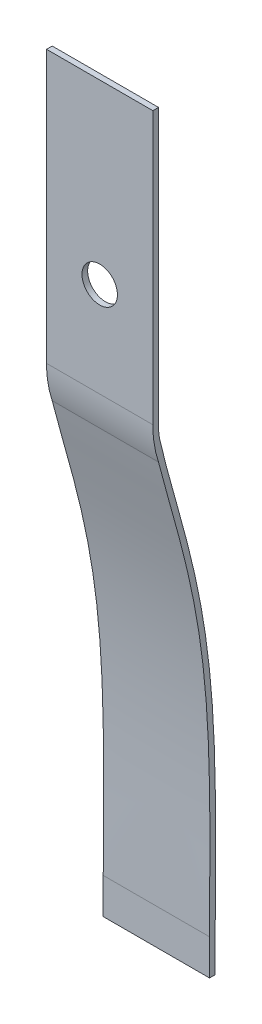
ISO-10303-21;
HEADER;
FILE_DESCRIPTION(('STEP AP214'),'2;1');
FILE_NAME('part.step','',(''),(''),'','','');
FILE_SCHEMA(('AUTOMOTIVE_DESIGN { 1 0 10303 214 1 1 1 1 }'));
ENDSEC;
DATA;
#1=APPLICATION_CONTEXT('core data for automotive mechanical design processes');
#2=APPLICATION_PROTOCOL_DEFINITION('international standard','automotive_design',2000,#1);
#3=PRODUCT_CONTEXT('',#1,'mechanical');
#4=PRODUCT('Part','Part','',(#3));
#5=PRODUCT_RELATED_PRODUCT_CATEGORY('part','',(#4));
#6=PRODUCT_DEFINITION_FORMATION('','',#4);
#7=PRODUCT_DEFINITION_CONTEXT('part definition',#1,'design');
#8=PRODUCT_DEFINITION('design','',#6,#7);
#9=PRODUCT_DEFINITION_SHAPE('','',#8);
#10=(LENGTH_UNIT() NAMED_UNIT(*) SI_UNIT(.MILLI.,.METRE.));
#11=(NAMED_UNIT(*) PLANE_ANGLE_UNIT() SI_UNIT($,.RADIAN.));
#12=(NAMED_UNIT(*) SI_UNIT($,.STERADIAN.) SOLID_ANGLE_UNIT());
#13=UNCERTAINTY_MEASURE_WITH_UNIT(LENGTH_MEASURE(1.E-05),#10,'distance_accuracy_value','');
#14=(GEOMETRIC_REPRESENTATION_CONTEXT(3) GLOBAL_UNCERTAINTY_ASSIGNED_CONTEXT((#13)) GLOBAL_UNIT_ASSIGNED_CONTEXT((#10,
#11,#12)) REPRESENTATION_CONTEXT('',''));
#15=CARTESIAN_POINT('',(0.,0.,0.));
#16=DIRECTION('',(0.,0.,1.));
#17=DIRECTION('',(1.,0.,0.));
#18=AXIS2_PLACEMENT_3D('',#15,#16,#17);
#19=CARTESIAN_POINT('',(0.,0.,0.));
#20=DIRECTION('',(0.,0.,-1.));
#21=DIRECTION('',(-1.,0.,0.));
#22=AXIS2_PLACEMENT_3D('',#19,#20,#21);
#23=PLANE('',#22);
#24=CARTESIAN_POINT('',(0.,107.95,0.));
#25=DIRECTION('',(0.,0.,1.));
#26=DIRECTION('',(1.,0.,0.));
#27=AXIS2_PLACEMENT_3D('',#24,#25,#26);
#28=CIRCLE('',#27,3.175);
#29=CARTESIAN_POINT('',(3.175,107.95,0.));
#30=VERTEX_POINT('',#29);
#31=EDGE_CURVE('E158',#30,#30,#28,.T.);
#32=ORIENTED_EDGE('',*,*,#31,.T.);
#33=EDGE_LOOP('',(#32));
#34=FACE_BOUND('',#33,.T.);
#35=DIRECTION('',(0.,1.,0.));
#36=VECTOR('',#35,1.);
#37=CARTESIAN_POINT('',(9.525,0.,0.));
#38=LINE('',#37,#36);
#39=CARTESIAN_POINT('',(9.525,90.1509479237421,0.));
#40=VERTEX_POINT('',#39);
#41=CARTESIAN_POINT('',(9.525,139.7,0.));
#42=VERTEX_POINT('',#41);
#43=EDGE_CURVE('E148',#40,#42,#38,.T.);
#44=ORIENTED_EDGE('',*,*,#43,.F.);
#45=DIRECTION('',(1.,0.,0.));
#46=VECTOR('',#45,1.);
#47=CARTESIAN_POINT('',(0.,90.1509479237421,0.));
#48=LINE('',#47,#46);
#49=CARTESIAN_POINT('',(-9.52500000000003,90.1509479237421,0.));
#50=VERTEX_POINT('',#49);
#51=EDGE_CURVE('E166',#40,#50,#48,.F.);
#52=ORIENTED_EDGE('',*,*,#51,.T.);
#53=DIRECTION('',(0.,-1.,0.));
#54=VECTOR('',#53,1.);
#55=CARTESIAN_POINT('',(-9.525,0.,0.));
#56=LINE('',#55,#54);
#57=CARTESIAN_POINT('',(-9.52500000000005,139.7,0.));
#58=VERTEX_POINT('',#57);
#59=EDGE_CURVE('E156',#58,#50,#56,.T.);
#60=ORIENTED_EDGE('',*,*,#59,.F.);
#61=DIRECTION('',(-1.,0.,0.));
#62=VECTOR('',#61,1.);
#63=CARTESIAN_POINT('',(-9.52500000000005,139.7,0.));
#64=LINE('',#63,#62);
#65=EDGE_CURVE('E145',#42,#58,#64,.T.);
#66=ORIENTED_EDGE('',*,*,#65,.F.);
#67=EDGE_LOOP('',(#44,#52,#60,#66));
#68=FACE_BOUND('',#67,.T.);
#69=ADVANCED_FACE('F45',(#34,#68),#23,.T.);
#70=CARTESIAN_POINT('',(-9.525,0.,1.016));
#71=DIRECTION('',(1.,0.,0.));
#72=DIRECTION('',(0.,1.,0.));
#73=AXIS2_PLACEMENT_3D('',#70,#71,#72);
#74=PLANE('',#73);
#75=CARTESIAN_POINT('',(-9.52500000000005,88.9121156954394,1.016));
#76=CARTESIAN_POINT('',(-9.52500000000005,72.7931267686388,-2.49788032629026));
#77=CARTESIAN_POINT('',(-9.52500000000005,58.7468680261173,-9.05640117695752));
#78=CARTESIAN_POINT('',(-9.52500000000005,42.3459915932572,-9.65555256754616));
#79=CARTESIAN_POINT('',(-9.52500000000005,23.3841648351209,-9.14399999999998));
#80=CARTESIAN_POINT('',(-9.52500000000005,6.39538559946243,-9.144));
#81=B_SPLINE_CURVE_WITH_KNOTS('',5,(#75,#76,#77,#78,#79,#80),.UNSPECIFIED.,.F.,.F.,(6,6),(0.,
1.),.UNSPECIFIED.);
#82=CARTESIAN_POINT('',(-9.52500000000005,84.6447012961835,4.65705490663992E-12));
#83=VERTEX_POINT('',#82);
#84=CARTESIAN_POINT('',(-9.52500000000005,6.39538559946243,-9.144));
#85=VERTEX_POINT('',#84);
#86=EDGE_CURVE('E137',#83,#85,#81,.T.);
#87=ORIENTED_EDGE('',*,*,#86,.F.);
#88=CARTESIAN_POINT('',(-9.52500000000005,84.6447012961835,4.65705490663992E-12));
#89=CARTESIAN_POINT('',(-9.52500000000005,87.704234074795,1.016));
#90=CARTESIAN_POINT('',(-9.52500000000005,90.9537566082065,1.016));
#91=B_SPLINE_CURVE_WITH_KNOTS('',2,(#88,#89,#90),.UNSPECIFIED.,.F.,.F.,(3,3),(0.,1.),.UNSPECIFIED.);
#92=CARTESIAN_POINT('',(-9.52500000000005,90.9537566082065,1.016));
#93=VERTEX_POINT('',#92);
#94=EDGE_CURVE('E122',#83,#93,#91,.T.);
#95=ORIENTED_EDGE('',*,*,#94,.T.);
#96=DIRECTION('',(0.,-1.,0.));
#97=VECTOR('',#96,1.);
#98=CARTESIAN_POINT('',(-9.525,0.,1.016));
#99=LINE('',#98,#97);
#100=CARTESIAN_POINT('',(-9.52500000000005,139.7,1.016));
#101=VERTEX_POINT('',#100);
#102=EDGE_CURVE('E135',#101,#93,#99,.T.);
#103=ORIENTED_EDGE('',*,*,#102,.F.);
#104=DIRECTION('',(0.,0.,-1.));
#105=VECTOR('',#104,1.);
#106=CARTESIAN_POINT('',(-9.52500000000005,139.7,1.016));
#107=LINE('',#106,#105);
#108=EDGE_CURVE('E155',#101,#58,#107,.T.);
#109=ORIENTED_EDGE('',*,*,#108,.T.);
#110=ORIENTED_EDGE('',*,*,#59,.T.);
#111=CARTESIAN_POINT('',(-9.52500000000003,90.1509479237421,-10.16));
#112=DIRECTION('',(1.,0.,0.));
#113=DIRECTION('',(0.,1.,0.));
#114=AXIS2_PLACEMENT_3D('',#111,#112,#113);
#115=CIRCLE('',#114,10.16);
#116=CARTESIAN_POINT('',(-9.52500000000005,87.8643144695002,-0.260661262188174));
#117=VERTEX_POINT('',#116);
#118=EDGE_CURVE('E53',#50,#117,#115,.T.);
#119=ORIENTED_EDGE('',*,*,#118,.T.);
#120=CARTESIAN_POINT('',(-9.52500000000005,89.1285176697962,0.0233136520055828));
#121=CARTESIAN_POINT('',(-9.52500000000005,87.4777452588777,-0.336548664685055));
#122=CARTESIAN_POINT('',(-9.52500000000005,84.182707509753,-1.14414066972838));
#123=CARTESIAN_POINT('',(-9.52500000000005,77.7372708649619,-2.91386689452682));
#124=CARTESIAN_POINT('',(-9.52500000000005,69.7349074302643,-5.1848494839027));
#125=CARTESIAN_POINT('',(-9.52500000000005,59.9446642526583,-7.46141538350429));
#126=CARTESIAN_POINT('',(-9.52500000000005,49.7868692204749,-9.04772174591774));
#127=CARTESIAN_POINT('',(-9.52500000000005,39.2122020230854,-9.92433970440907));
#128=CARTESIAN_POINT('',(-9.52500000000005,30.1079992798011,-10.1830449934907));
#129=CARTESIAN_POINT('',(-9.52500000000005,22.7478534862296,-10.2251028786919));
#130=CARTESIAN_POINT('',(-9.52500000000005,17.2263039802676,-10.2075813070374));
#131=CARTESIAN_POINT('',(-9.52500000000005,12.6640056581336,-10.1791579416986));
#132=CARTESIAN_POINT('',(-9.52500000000005,9.05650550998635,-10.1633374811313));
#133=CARTESIAN_POINT('',(-9.52500000000005,7.2851242220595,-10.16));
#134=CARTESIAN_POINT('',(-9.52500000000005,6.39538559946243,-10.16));
#135=B_SPLINE_CURVE_WITH_KNOTS('',3,(#120,#121,#122,#123,#124,#125,#126,#127,#128,#129,#130,
#131,#132,#133,#134),.UNSPECIFIED.,.F.,.F.,(4,1,1,1,1,1,1,1,1,1,1,1,4),(0.,0.0625,0.125,0.25,
0.375,0.5,0.625,0.75,0.8125,0.875,0.9375,0.96875,1.),.UNSPECIFIED.);
#136=CARTESIAN_POINT('',(-9.52500000000005,6.39538559946243,-10.16));
#137=VERTEX_POINT('',#136);
#138=EDGE_CURVE('E333',#117,#137,#135,.T.);
#139=ORIENTED_EDGE('',*,*,#138,.T.);
#140=DIRECTION('',(0.,1.,0.));
#141=VECTOR('',#140,1.);
#142=CARTESIAN_POINT('',(-9.52500000000005,0.,-10.16));
#143=LINE('',#142,#141);
#144=CARTESIAN_POINT('',(-9.52500000000005,0.,-10.16));
#145=VERTEX_POINT('',#144);
#146=EDGE_CURVE('E354',#145,#137,#143,.T.);
#147=ORIENTED_EDGE('',*,*,#146,.F.);
#148=DIRECTION('',(0.,0.,1.));
#149=VECTOR('',#148,1.);
#150=CARTESIAN_POINT('',(-9.52500000000005,0.,-10.16));
#151=LINE('',#150,#149);
#152=CARTESIAN_POINT('',(-9.52500000000005,0.,-9.144));
#153=VERTEX_POINT('',#152);
#154=EDGE_CURVE('E361',#145,#153,#151,.T.);
#155=ORIENTED_EDGE('',*,*,#154,.T.);
#156=DIRECTION('',(0.,1.,0.));
#157=VECTOR('',#156,1.);
#158=CARTESIAN_POINT('',(-9.52500000000005,0.,-9.144));
#159=LINE('',#158,#157);
#160=EDGE_CURVE('E311',#153,#85,#159,.T.);
#161=ORIENTED_EDGE('',*,*,#160,.T.);
#162=EDGE_LOOP('',(#87,#95,#103,#109,#110,#119,#139,#147,#155,#161));
#163=FACE_BOUND('',#162,.T.);
#164=ADVANCED_FACE('F133',(#163),#74,.F.);
#165=CARTESIAN_POINT('',(9.525,0.,1.016));
#166=DIRECTION('',(-1.,0.,0.));
#167=DIRECTION('',(0.,0.,1.));
#168=AXIS2_PLACEMENT_3D('',#165,#166,#167);
#169=PLANE('',#168);
#170=DIRECTION('',(0.,1.,0.));
#171=VECTOR('',#170,1.);
#172=CARTESIAN_POINT('',(9.525,0.,1.016));
#173=LINE('',#172,#171);
#174=CARTESIAN_POINT('',(9.525,90.9537566082065,1.016));
#175=VERTEX_POINT('',#174);
#176=CARTESIAN_POINT('',(9.525,139.7,1.016));
#177=VERTEX_POINT('',#176);
#178=EDGE_CURVE('E144',#175,#177,#173,.T.);
#179=ORIENTED_EDGE('',*,*,#178,.F.);
#180=CARTESIAN_POINT('',(9.525,84.6447012961835,4.65705490663992E-12));
#181=CARTESIAN_POINT('',(9.525,87.704234074795,1.016));
#182=CARTESIAN_POINT('',(9.525,90.9537566082065,1.016));
#183=B_SPLINE_CURVE_WITH_KNOTS('',2,(#180,#181,#182),.UNSPECIFIED.,.F.,.F.,(3,3),(0.,1.),.UNSPECIFIED.);
#184=CARTESIAN_POINT('',(9.525,84.644701296203,9.64975170082705E-12));
#185=VERTEX_POINT('',#184);
#186=EDGE_CURVE('E125',#185,#175,#183,.T.);
#187=ORIENTED_EDGE('',*,*,#186,.F.);
#188=CARTESIAN_POINT('',(9.525,88.9121156954394,1.016));
#189=CARTESIAN_POINT('',(9.525,72.7931267686388,-2.49788032629026));
#190=CARTESIAN_POINT('',(9.525,58.7468680261173,-9.05640117695752));
#191=CARTESIAN_POINT('',(9.525,42.3459915932572,-9.65555256754616));
#192=CARTESIAN_POINT('',(9.525,23.3841648351209,-9.14399999999998));
#193=CARTESIAN_POINT('',(9.525,6.39538559946243,-9.144));
#194=B_SPLINE_CURVE_WITH_KNOTS('',5,(#188,#189,#190,#191,#192,#193),.UNSPECIFIED.,.F.,.F.,(6,6),
(0.,1.),.UNSPECIFIED.);
#195=CARTESIAN_POINT('',(9.525,6.39538559946243,-9.144));
#196=VERTEX_POINT('',#195);
#197=EDGE_CURVE('E329',#185,#196,#194,.T.);
#198=ORIENTED_EDGE('',*,*,#197,.T.);
#199=DIRECTION('',(0.,1.,0.));
#200=VECTOR('',#199,1.);
#201=CARTESIAN_POINT('',(9.525,0.,-9.144));
#202=LINE('',#201,#200);
#203=CARTESIAN_POINT('',(9.525,0.,-9.144));
#204=VERTEX_POINT('',#203);
#205=EDGE_CURVE('E326',#204,#196,#202,.T.);
#206=ORIENTED_EDGE('',*,*,#205,.F.);
#207=DIRECTION('',(0.,0.,1.));
#208=VECTOR('',#207,1.);
#209=CARTESIAN_POINT('',(9.525,0.,-10.16));
#210=LINE('',#209,#208);
#211=CARTESIAN_POINT('',(9.525,0.,-10.16));
#212=VERTEX_POINT('',#211);
#213=EDGE_CURVE('E324',#212,#204,#210,.T.);
#214=ORIENTED_EDGE('',*,*,#213,.F.);
#215=DIRECTION('',(0.,1.,0.));
#216=VECTOR('',#215,1.);
#217=CARTESIAN_POINT('',(9.525,0.,-10.16));
#218=LINE('',#217,#216);
#219=CARTESIAN_POINT('',(9.525,6.39538559946243,-10.16));
#220=VERTEX_POINT('',#219);
#221=EDGE_CURVE('E319',#212,#220,#218,.T.);
#222=ORIENTED_EDGE('',*,*,#221,.T.);
#223=CARTESIAN_POINT('',(9.525,89.1285176697962,0.0233136520055828));
#224=CARTESIAN_POINT('',(9.525,87.4777452588777,-0.336548664685055));
#225=CARTESIAN_POINT('',(9.525,84.182707509753,-1.14414066972838));
#226=CARTESIAN_POINT('',(9.525,77.7372708649619,-2.91386689452682));
#227=CARTESIAN_POINT('',(9.525,69.7349074302643,-5.1848494839027));
#228=CARTESIAN_POINT('',(9.525,59.9446642526583,-7.46141538350429));
#229=CARTESIAN_POINT('',(9.525,49.7868692204749,-9.04772174591774));
#230=CARTESIAN_POINT('',(9.525,39.2122020230854,-9.92433970440907));
#231=CARTESIAN_POINT('',(9.525,30.1079992798011,-10.1830449934907));
#232=CARTESIAN_POINT('',(9.525,22.7478534862296,-10.2251028786919));
#233=CARTESIAN_POINT('',(9.525,17.2263039802676,-10.2075813070374));
#234=CARTESIAN_POINT('',(9.525,12.6640056581336,-10.1791579416986));
#235=CARTESIAN_POINT('',(9.525,9.05650550998635,-10.1633374811313));
#236=CARTESIAN_POINT('',(9.525,7.2851242220595,-10.16));
#237=CARTESIAN_POINT('',(9.525,6.39538559946243,-10.16));
#238=B_SPLINE_CURVE_WITH_KNOTS('',3,(#223,#224,#225,#226,#227,#228,#229,#230,#231,#232,#233,
#234,#235,#236,#237),.UNSPECIFIED.,.F.,.F.,(4,1,1,1,1,1,1,1,1,1,1,1,4),(0.,0.0625,0.125,0.25,
0.375,0.5,0.625,0.75,0.8125,0.875,0.9375,0.96875,1.),.UNSPECIFIED.);
#239=CARTESIAN_POINT('',(9.525,87.8643144695002,-0.260661262188168));
#240=VERTEX_POINT('',#239);
#241=EDGE_CURVE('E129',#240,#220,#238,.T.);
#242=ORIENTED_EDGE('',*,*,#241,.F.);
#243=CARTESIAN_POINT('',(9.525,90.1509479237421,-10.16));
#244=DIRECTION('',(-1.,0.,0.));
#245=DIRECTION('',(0.,0.,1.));
#246=AXIS2_PLACEMENT_3D('',#243,#244,#245);
#247=CIRCLE('',#246,10.16);
#248=EDGE_CURVE('E13',#240,#40,#247,.T.);
#249=ORIENTED_EDGE('',*,*,#248,.T.);
#250=ORIENTED_EDGE('',*,*,#43,.T.);
#251=DIRECTION('',(0.,0.,-1.));
#252=VECTOR('',#251,1.);
#253=CARTESIAN_POINT('',(9.525,139.7,1.016));
#254=LINE('',#253,#252);
#255=EDGE_CURVE('E161',#177,#42,#254,.T.);
#256=ORIENTED_EDGE('',*,*,#255,.F.);
#257=EDGE_LOOP('',(#179,#187,#198,#206,#214,#222,#242,#249,#250,#256));
#258=FACE_BOUND('',#257,.T.);
#259=ADVANCED_FACE('F180',(#258),#169,.F.);
#260=CARTESIAN_POINT('',(-9.52500000000005,139.7,1.016));
#261=DIRECTION('',(0.,-1.,0.));
#262=DIRECTION('',(0.,0.,-1.));
#263=AXIS2_PLACEMENT_3D('',#260,#261,#262);
#264=PLANE('',#263);
#265=ORIENTED_EDGE('',*,*,#65,.T.);
#266=ORIENTED_EDGE('',*,*,#108,.F.);
#267=DIRECTION('',(-1.,0.,0.));
#268=VECTOR('',#267,1.);
#269=CARTESIAN_POINT('',(-9.52500000000005,139.7,1.016));
#270=LINE('',#269,#268);
#271=EDGE_CURVE('E142',#177,#101,#270,.T.);
#272=ORIENTED_EDGE('',*,*,#271,.F.);
#273=ORIENTED_EDGE('',*,*,#255,.T.);
#274=EDGE_LOOP('',(#265,#266,#272,#273));
#275=FACE_BOUND('',#274,.T.);
#276=ADVANCED_FACE('F177',(#275),#264,.F.);
#277=CARTESIAN_POINT('',(0.,0.,1.016));
#278=DIRECTION('',(0.,0.,-1.));
#279=DIRECTION('',(-1.,0.,0.));
#280=AXIS2_PLACEMENT_3D('',#277,#278,#279);
#281=PLANE('',#280);
#282=ORIENTED_EDGE('',*,*,#102,.T.);
#283=DIRECTION('',(1.,0.,0.));
#284=VECTOR('',#283,1.);
#285=CARTESIAN_POINT('',(-9.52500000000005,90.9537566082065,1.016));
#286=LINE('',#285,#284);
#287=EDGE_CURVE('E119',#93,#175,#286,.T.);
#288=ORIENTED_EDGE('',*,*,#287,.T.);
#289=ORIENTED_EDGE('',*,*,#178,.T.);
#290=ORIENTED_EDGE('',*,*,#271,.T.);
#291=EDGE_LOOP('',(#282,#288,#289,#290));
#292=FACE_BOUND('',#291,.T.);
#293=CARTESIAN_POINT('',(0.,107.95,1.016));
#294=DIRECTION('',(0.,0.,1.));
#295=DIRECTION('',(1.,0.,0.));
#296=AXIS2_PLACEMENT_3D('',#293,#294,#295);
#297=CIRCLE('',#296,3.175);
#298=CARTESIAN_POINT('',(3.175,107.95,1.016));
#299=VERTEX_POINT('',#298);
#300=EDGE_CURVE('E151',#299,#299,#297,.T.);
#301=ORIENTED_EDGE('',*,*,#300,.F.);
#302=EDGE_LOOP('',(#301));
#303=FACE_BOUND('',#302,.T.);
#304=ADVANCED_FACE('F139',(#292,#303),#281,.F.);
#305=CARTESIAN_POINT('',(0.,107.95,0.));
#306=DIRECTION('',(0.,0.,1.));
#307=DIRECTION('',(1.,0.,0.));
#308=AXIS2_PLACEMENT_3D('',#305,#306,#307);
#309=CYLINDRICAL_SURFACE('',#308,3.175);
#310=ORIENTED_EDGE('',*,*,#31,.F.);
#311=EDGE_LOOP('',(#310));
#312=FACE_BOUND('',#311,.T.);
#313=ORIENTED_EDGE('',*,*,#300,.T.);
#314=EDGE_LOOP('',(#313));
#315=FACE_BOUND('',#314,.T.);
#316=ADVANCED_FACE('F217',(#312,#315),#309,.F.);
#317=DIRECTION('',(1.,0.,0.));
#318=VECTOR('',#317,1.);
#319=SURFACE_OF_LINEAR_EXTRUSION('',#135,#318);
#320=ORIENTED_EDGE('',*,*,#138,.F.);
#321=DIRECTION('',(1.,0.,0.));
#322=VECTOR('',#321,1.);
#323=CARTESIAN_POINT('',(-9.52500000000005,87.8643144695002,-0.260661262188178));
#324=LINE('',#323,#322);
#325=EDGE_CURVE('E66',#117,#240,#324,.T.);
#326=ORIENTED_EDGE('',*,*,#325,.T.);
#327=ORIENTED_EDGE('',*,*,#241,.T.);
#328=DIRECTION('',(1.,0.,0.));
#329=VECTOR('',#328,1.);
#330=CARTESIAN_POINT('',(-9.52500000000005,6.39538559946243,-10.16));
#331=LINE('',#330,#329);
#332=EDGE_CURVE('E344',#137,#220,#331,.T.);
#333=ORIENTED_EDGE('',*,*,#332,.F.);
#334=EDGE_LOOP('',(#320,#326,#327,#333));
#335=FACE_BOUND('',#334,.T.);
#336=ADVANCED_FACE('F224',(#335),#319,.F.);
#337=CARTESIAN_POINT('',(-9.52500000000005,0.,-10.16));
#338=DIRECTION('',(0.,0.,-1.));
#339=DIRECTION('',(-1.,0.,0.));
#340=AXIS2_PLACEMENT_3D('',#337,#338,#339);
#341=PLANE('',#340);
#342=ORIENTED_EDGE('',*,*,#221,.F.);
#343=DIRECTION('',(1.,0.,0.));
#344=VECTOR('',#343,1.);
#345=CARTESIAN_POINT('',(-9.52500000000005,0.,-10.16));
#346=LINE('',#345,#344);
#347=EDGE_CURVE('E342',#145,#212,#346,.T.);
#348=ORIENTED_EDGE('',*,*,#347,.F.);
#349=ORIENTED_EDGE('',*,*,#146,.T.);
#350=ORIENTED_EDGE('',*,*,#332,.T.);
#351=EDGE_LOOP('',(#342,#348,#349,#350));
#352=FACE_BOUND('',#351,.T.);
#353=ADVANCED_FACE('F231',(#352),#341,.T.);
#354=CARTESIAN_POINT('',(-9.52500000000005,0.,-10.16));
#355=DIRECTION('',(0.,1.,0.));
#356=DIRECTION('',(0.,0.,1.));
#357=AXIS2_PLACEMENT_3D('',#354,#355,#356);
#358=PLANE('',#357);
#359=ORIENTED_EDGE('',*,*,#213,.T.);
#360=DIRECTION('',(1.,0.,0.));
#361=VECTOR('',#360,1.);
#362=CARTESIAN_POINT('',(-9.52500000000005,0.,-9.144));
#363=LINE('',#362,#361);
#364=EDGE_CURVE('E339',#153,#204,#363,.T.);
#365=ORIENTED_EDGE('',*,*,#364,.F.);
#366=ORIENTED_EDGE('',*,*,#154,.F.);
#367=ORIENTED_EDGE('',*,*,#347,.T.);
#368=EDGE_LOOP('',(#359,#365,#366,#367));
#369=FACE_BOUND('',#368,.T.);
#370=ADVANCED_FACE('F237',(#369),#358,.F.);
#371=CARTESIAN_POINT('',(-9.52500000000005,0.,-9.144));
#372=DIRECTION('',(0.,0.,-1.));
#373=DIRECTION('',(-1.,0.,0.));
#374=AXIS2_PLACEMENT_3D('',#371,#372,#373);
#375=PLANE('',#374);
#376=ORIENTED_EDGE('',*,*,#205,.T.);
#377=DIRECTION('',(1.,0.,0.));
#378=VECTOR('',#377,1.);
#379=CARTESIAN_POINT('',(-9.52500000000005,6.39538559946243,-9.144));
#380=LINE('',#379,#378);
#381=EDGE_CURVE('E310',#85,#196,#380,.T.);
#382=ORIENTED_EDGE('',*,*,#381,.F.);
#383=ORIENTED_EDGE('',*,*,#160,.F.);
#384=ORIENTED_EDGE('',*,*,#364,.T.);
#385=EDGE_LOOP('',(#376,#382,#383,#384));
#386=FACE_BOUND('',#385,.T.);
#387=ADVANCED_FACE('F245',(#386),#375,.F.);
#388=DIRECTION('',(1.,0.,0.));
#389=VECTOR('',#388,1.);
#390=SURFACE_OF_LINEAR_EXTRUSION('',#81,#389);
#391=ORIENTED_EDGE('',*,*,#197,.F.);
#392=DIRECTION('',(1.,0.,0.));
#393=VECTOR('',#392,1.);
#394=CARTESIAN_POINT('',(-9.52500000000005,84.6447012961745,2.34052143985308E-12));
#395=LINE('',#394,#393);
#396=EDGE_CURVE('E164',#185,#83,#395,.F.);
#397=ORIENTED_EDGE('',*,*,#396,.T.);
#398=ORIENTED_EDGE('',*,*,#86,.T.);
#399=ORIENTED_EDGE('',*,*,#381,.T.);
#400=EDGE_LOOP('',(#391,#397,#398,#399));
#401=FACE_BOUND('',#400,.T.);
#402=ADVANCED_FACE('F186',(#401),#390,.T.);
#403=DIRECTION('',(1.,0.,0.));
#404=VECTOR('',#403,1.);
#405=SURFACE_OF_LINEAR_EXTRUSION('',#91,#404);
#406=ORIENTED_EDGE('',*,*,#186,.T.);
#407=ORIENTED_EDGE('',*,*,#287,.F.);
#408=ORIENTED_EDGE('',*,*,#94,.F.);
#409=ORIENTED_EDGE('',*,*,#396,.F.);
#410=EDGE_LOOP('',(#406,#407,#408,#409));
#411=FACE_BOUND('',#410,.T.);
#412=ADVANCED_FACE('F121',(#411),#405,.F.);
#413=CARTESIAN_POINT('',(0.,90.1509479237421,-10.16));
#414=DIRECTION('',(1.,0.,0.));
#415=DIRECTION('',(0.,0.,-1.));
#416=AXIS2_PLACEMENT_3D('',#413,#414,#415);
#417=CYLINDRICAL_SURFACE('',#416,10.16);
#418=ORIENTED_EDGE('',*,*,#248,.F.);
#419=ORIENTED_EDGE('',*,*,#325,.F.);
#420=ORIENTED_EDGE('',*,*,#118,.F.);
#421=ORIENTED_EDGE('',*,*,#51,.F.);
#422=EDGE_LOOP('',(#418,#419,#420,#421));
#423=FACE_BOUND('',#422,.T.);
#424=ADVANCED_FACE('F47',(#423),#417,.F.);
#425=CLOSED_SHELL('',(#69,#164,#259,#276,#304,#316,#336,#353,#370,#387,#402,#412,#424));
#426=MANIFOLD_SOLID_BREP('B2',#425);
#427=ADVANCED_BREP_SHAPE_REPRESENTATION('',(#18,#426),#14);
#428=SHAPE_DEFINITION_REPRESENTATION(#9,#427);
ENDSEC;
END-ISO-10303-21;
